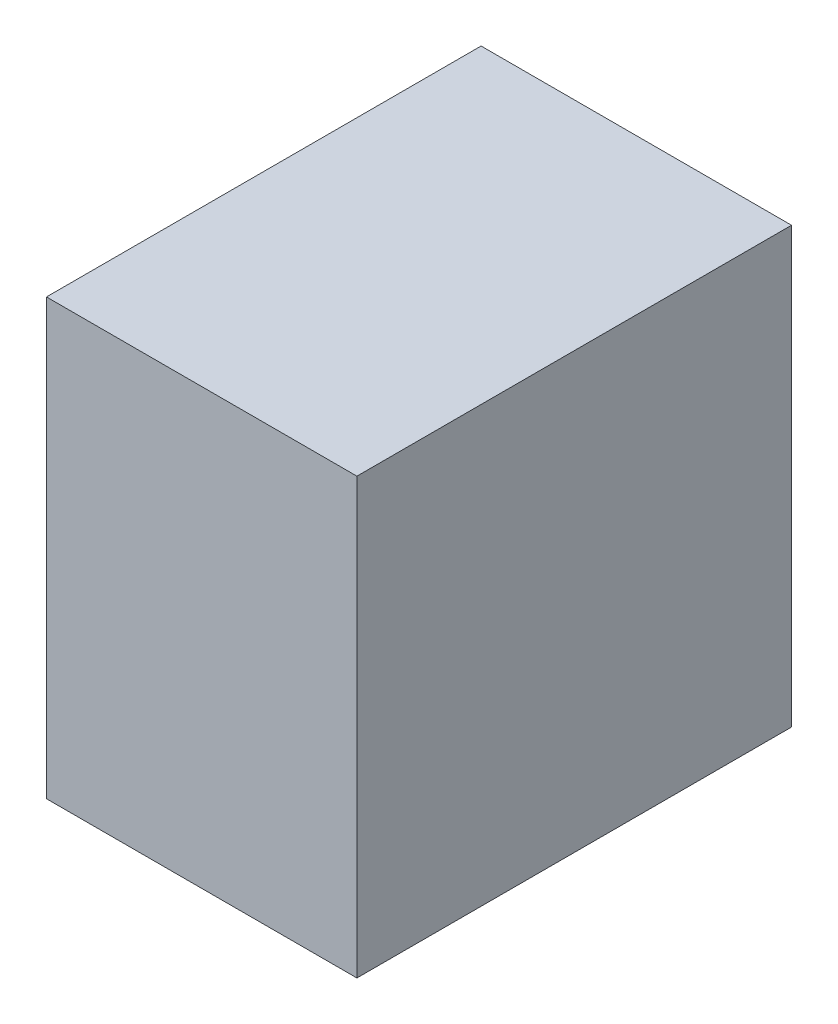
ISO-10303-21;
HEADER;
FILE_DESCRIPTION(('STEP AP214'),'2;1');
FILE_NAME('part.step','',(''),(''),'','','');
FILE_SCHEMA(('AUTOMOTIVE_DESIGN { 1 0 10303 214 1 1 1 1 }'));
ENDSEC;
DATA;
#1=APPLICATION_CONTEXT('core data for automotive mechanical design processes');
#2=APPLICATION_PROTOCOL_DEFINITION('international standard','automotive_design',2000,#1);
#3=PRODUCT_CONTEXT('',#1,'mechanical');
#4=PRODUCT('Part','Part','',(#3));
#5=PRODUCT_RELATED_PRODUCT_CATEGORY('part','',(#4));
#6=PRODUCT_DEFINITION_FORMATION('','',#4);
#7=PRODUCT_DEFINITION_CONTEXT('part definition',#1,'design');
#8=PRODUCT_DEFINITION('design','',#6,#7);
#9=PRODUCT_DEFINITION_SHAPE('','',#8);
#10=(LENGTH_UNIT() NAMED_UNIT(*) SI_UNIT(.MILLI.,.METRE.));
#11=(NAMED_UNIT(*) PLANE_ANGLE_UNIT() SI_UNIT($,.RADIAN.));
#12=(NAMED_UNIT(*) SI_UNIT($,.STERADIAN.) SOLID_ANGLE_UNIT());
#13=UNCERTAINTY_MEASURE_WITH_UNIT(LENGTH_MEASURE(1.E-05),#10,'distance_accuracy_value','');
#14=(GEOMETRIC_REPRESENTATION_CONTEXT(3) GLOBAL_UNCERTAINTY_ASSIGNED_CONTEXT((#13)) GLOBAL_UNIT_ASSIGNED_CONTEXT((#10,
#11,#12)) REPRESENTATION_CONTEXT('',''));
#15=CARTESIAN_POINT('',(0.,0.,0.));
#16=DIRECTION('',(0.,0.,1.));
#17=DIRECTION('',(1.,0.,0.));
#18=AXIS2_PLACEMENT_3D('',#15,#16,#17);
#19=CARTESIAN_POINT('',(15.24,-0.35,-2.08));
#20=DIRECTION('',(-1.,0.,0.));
#21=DIRECTION('',(0.,0.,1.));
#22=AXIS2_PLACEMENT_3D('',#19,#20,#21);
#23=PLANE('',#22);
#24=DIRECTION('',(0.,0.,-1.));
#25=VECTOR('',#24,1.);
#26=CARTESIAN_POINT('',(15.24,0.,0.));
#27=LINE('',#26,#25);
#28=CARTESIAN_POINT('',(15.24,0.,-0.75));
#29=VERTEX_POINT('',#28);
#30=CARTESIAN_POINT('',(15.24,0.,-1.1));
#31=VERTEX_POINT('',#30);
#32=EDGE_CURVE('E11',#29,#31,#27,.T.);
#33=ORIENTED_EDGE('',*,*,#32,.F.);
#34=DIRECTION('',(0.,-1.,0.));
#35=VECTOR('',#34,1.);
#36=CARTESIAN_POINT('',(15.24,-0.35,-0.75));
#37=LINE('',#36,#35);
#38=CARTESIAN_POINT('',(15.24,-0.35,-0.75));
#39=VERTEX_POINT('',#38);
#40=EDGE_CURVE('E98',#29,#39,#37,.T.);
#41=ORIENTED_EDGE('',*,*,#40,.T.);
#42=DIRECTION('',(0.,0.,1.));
#43=VECTOR('',#42,1.);
#44=CARTESIAN_POINT('',(15.24,-0.35,-2.08));
#45=LINE('',#44,#43);
#46=CARTESIAN_POINT('',(15.24,-0.35,-1.1));
#47=VERTEX_POINT('',#46);
#48=EDGE_CURVE('E27',#47,#39,#45,.T.);
#49=ORIENTED_EDGE('',*,*,#48,.F.);
#50=DIRECTION('',(0.,-1.,0.));
#51=VECTOR('',#50,1.);
#52=CARTESIAN_POINT('',(15.24,-0.35,-1.1));
#53=LINE('',#52,#51);
#54=EDGE_CURVE('E115',#31,#47,#53,.T.);
#55=ORIENTED_EDGE('',*,*,#54,.F.);
#56=EDGE_LOOP('',(#33,#41,#49,#55));
#57=FACE_BOUND('',#56,.T.);
#58=ADVANCED_FACE('F16',(#57),#23,.F.);
#59=CARTESIAN_POINT('',(0.,0.,0.));
#60=DIRECTION('',(0.,-1.,0.));
#61=DIRECTION('',(0.,0.,-1.));
#62=AXIS2_PLACEMENT_3D('',#59,#60,#61);
#63=PLANE('',#62);
#64=DIRECTION('',(1.,0.,0.));
#65=VECTOR('',#64,1.);
#66=CARTESIAN_POINT('',(0.,0.,-0.75));
#67=LINE('',#66,#65);
#68=CARTESIAN_POINT('',(14.99,0.,-0.75));
#69=VERTEX_POINT('',#68);
#70=EDGE_CURVE('E103',#69,#29,#67,.T.);
#71=ORIENTED_EDGE('',*,*,#70,.T.);
#72=ORIENTED_EDGE('',*,*,#32,.T.);
#73=DIRECTION('',(1.,0.,0.));
#74=VECTOR('',#73,1.);
#75=CARTESIAN_POINT('',(0.,0.,-1.1));
#76=LINE('',#75,#74);
#77=CARTESIAN_POINT('',(14.99,0.,-1.1));
#78=VERTEX_POINT('',#77);
#79=EDGE_CURVE('E116',#78,#31,#76,.T.);
#80=ORIENTED_EDGE('',*,*,#79,.F.);
#81=DIRECTION('',(0.,0.,1.));
#82=VECTOR('',#81,1.);
#83=CARTESIAN_POINT('',(14.99,0.,0.));
#84=LINE('',#83,#82);
#85=EDGE_CURVE('E20',#78,#69,#84,.T.);
#86=ORIENTED_EDGE('',*,*,#85,.T.);
#87=EDGE_LOOP('',(#71,#72,#80,#86));
#88=FACE_BOUND('',#87,.T.);
#89=ADVANCED_FACE('F128',(#88),#63,.F.);
#90=CARTESIAN_POINT('',(0.,-0.35,0.));
#91=DIRECTION('',(0.,-1.,0.));
#92=DIRECTION('',(0.,0.,-1.));
#93=AXIS2_PLACEMENT_3D('',#90,#91,#92);
#94=PLANE('',#93);
#95=ORIENTED_EDGE('',*,*,#48,.T.);
#96=DIRECTION('',(1.,0.,0.));
#97=VECTOR('',#96,1.);
#98=CARTESIAN_POINT('',(0.,-0.35,-0.75));
#99=LINE('',#98,#97);
#100=CARTESIAN_POINT('',(14.99,-0.35,-0.75));
#101=VERTEX_POINT('',#100);
#102=EDGE_CURVE('E87',#101,#39,#99,.T.);
#103=ORIENTED_EDGE('',*,*,#102,.F.);
#104=DIRECTION('',(0.,0.,1.));
#105=VECTOR('',#104,1.);
#106=CARTESIAN_POINT('',(14.99,-0.35,0.));
#107=LINE('',#106,#105);
#108=CARTESIAN_POINT('',(14.99,-0.35,-1.1));
#109=VERTEX_POINT('',#108);
#110=EDGE_CURVE('E42',#109,#101,#107,.T.);
#111=ORIENTED_EDGE('',*,*,#110,.F.);
#112=DIRECTION('',(1.,0.,0.));
#113=VECTOR('',#112,1.);
#114=CARTESIAN_POINT('',(0.,-0.35,-1.1));
#115=LINE('',#114,#113);
#116=EDGE_CURVE('E90',#109,#47,#115,.T.);
#117=ORIENTED_EDGE('',*,*,#116,.T.);
#118=EDGE_LOOP('',(#95,#103,#111,#117));
#119=FACE_BOUND('',#118,.T.);
#120=ADVANCED_FACE('F86',(#119),#94,.T.);
#121=CARTESIAN_POINT('',(14.99,-0.35,0.));
#122=DIRECTION('',(-1.,0.,0.));
#123=DIRECTION('',(0.,0.,1.));
#124=AXIS2_PLACEMENT_3D('',#121,#122,#123);
#125=PLANE('',#124);
#126=ORIENTED_EDGE('',*,*,#85,.F.);
#127=DIRECTION('',(0.,1.,0.));
#128=VECTOR('',#127,1.);
#129=CARTESIAN_POINT('',(14.99,-0.35,-1.1));
#130=LINE('',#129,#128);
#131=EDGE_CURVE('E104',#109,#78,#130,.T.);
#132=ORIENTED_EDGE('',*,*,#131,.F.);
#133=ORIENTED_EDGE('',*,*,#110,.T.);
#134=DIRECTION('',(0.,1.,0.));
#135=VECTOR('',#134,1.);
#136=CARTESIAN_POINT('',(14.99,-0.35,-0.75));
#137=LINE('',#136,#135);
#138=EDGE_CURVE('E99',#101,#69,#137,.T.);
#139=ORIENTED_EDGE('',*,*,#138,.T.);
#140=EDGE_LOOP('',(#126,#132,#133,#139));
#141=FACE_BOUND('',#140,.T.);
#142=ADVANCED_FACE('F129',(#141),#125,.T.);
#143=CARTESIAN_POINT('',(0.,-0.35,-0.75));
#144=DIRECTION('',(0.,0.,1.));
#145=DIRECTION('',(1.,0.,0.));
#146=AXIS2_PLACEMENT_3D('',#143,#144,#145);
#147=PLANE('',#146);
#148=ORIENTED_EDGE('',*,*,#40,.F.);
#149=ORIENTED_EDGE('',*,*,#70,.F.);
#150=ORIENTED_EDGE('',*,*,#138,.F.);
#151=ORIENTED_EDGE('',*,*,#102,.T.);
#152=EDGE_LOOP('',(#148,#149,#150,#151));
#153=FACE_BOUND('',#152,.T.);
#154=ADVANCED_FACE('F96',(#153),#147,.T.);
#155=CARTESIAN_POINT('',(0.,-0.35,-1.1));
#156=DIRECTION('',(0.,0.,1.));
#157=DIRECTION('',(1.,0.,0.));
#158=AXIS2_PLACEMENT_3D('',#155,#156,#157);
#159=PLANE('',#158);
#160=ORIENTED_EDGE('',*,*,#79,.T.);
#161=ORIENTED_EDGE('',*,*,#54,.T.);
#162=ORIENTED_EDGE('',*,*,#116,.F.);
#163=ORIENTED_EDGE('',*,*,#131,.T.);
#164=EDGE_LOOP('',(#160,#161,#162,#163));
#165=FACE_BOUND('',#164,.T.);
#166=ADVANCED_FACE('F18',(#165),#159,.F.);
#167=CLOSED_SHELL('',(#58,#89,#120,#142,#154,#166));
#168=MANIFOLD_SOLID_BREP('B1',#167);
#169=ADVANCED_BREP_SHAPE_REPRESENTATION('',(#18,#168),#14);
#170=SHAPE_DEFINITION_REPRESENTATION(#9,#169);
ENDSEC;
END-ISO-10303-21;
